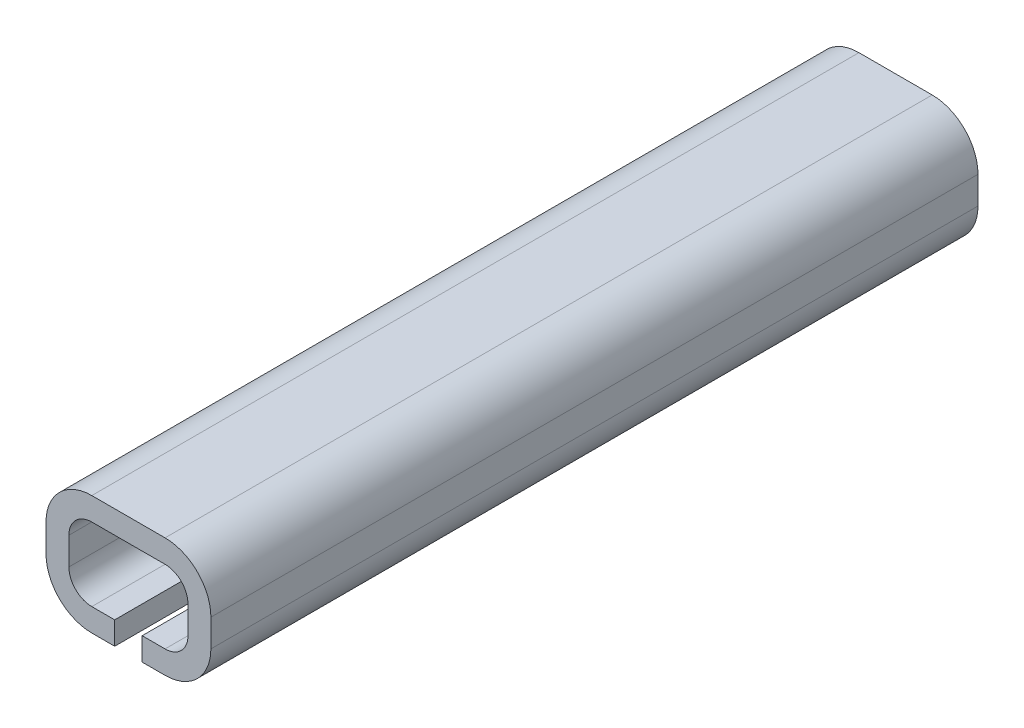
ISO-10303-21;
HEADER;
FILE_DESCRIPTION(('STEP AP214'),'2;1');
FILE_NAME('part.step','',(''),(''),'','','');
FILE_SCHEMA(('AUTOMOTIVE_DESIGN { 1 0 10303 214 1 1 1 1 }'));
ENDSEC;
DATA;
#1=APPLICATION_CONTEXT('core data for automotive mechanical design processes');
#2=APPLICATION_PROTOCOL_DEFINITION('international standard','automotive_design',2000,#1);
#3=PRODUCT_CONTEXT('',#1,'mechanical');
#4=PRODUCT('Part','Part','',(#3));
#5=PRODUCT_RELATED_PRODUCT_CATEGORY('part','',(#4));
#6=PRODUCT_DEFINITION_FORMATION('','',#4);
#7=PRODUCT_DEFINITION_CONTEXT('part definition',#1,'design');
#8=PRODUCT_DEFINITION('design','',#6,#7);
#9=PRODUCT_DEFINITION_SHAPE('','',#8);
#10=(LENGTH_UNIT() NAMED_UNIT(*) SI_UNIT(.MILLI.,.METRE.));
#11=(NAMED_UNIT(*) PLANE_ANGLE_UNIT() SI_UNIT($,.RADIAN.));
#12=(NAMED_UNIT(*) SI_UNIT($,.STERADIAN.) SOLID_ANGLE_UNIT());
#13=UNCERTAINTY_MEASURE_WITH_UNIT(LENGTH_MEASURE(1.E-05),#10,'distance_accuracy_value','');
#14=(GEOMETRIC_REPRESENTATION_CONTEXT(3) GLOBAL_UNCERTAINTY_ASSIGNED_CONTEXT((#13)) GLOBAL_UNIT_ASSIGNED_CONTEXT((#10,
#11,#12)) REPRESENTATION_CONTEXT('',''));
#15=CARTESIAN_POINT('',(0.,0.,0.));
#16=DIRECTION('',(0.,0.,1.));
#17=DIRECTION('',(1.,0.,0.));
#18=AXIS2_PLACEMENT_3D('',#15,#16,#17);
#19=CARTESIAN_POINT('',(1.6,-1.6,10.));
#20=DIRECTION('',(0.,-1.,0.));
#21=DIRECTION('',(1.,0.,0.));
#22=AXIS2_PLACEMENT_3D('',#19,#20,#21);
#23=PLANE('',#22);
#24=DIRECTION('',(-1.,0.,0.));
#25=VECTOR('',#24,1.);
#26=CARTESIAN_POINT('',(1.6,-1.6,10.));
#27=LINE('',#26,#25);
#28=CARTESIAN_POINT('',(-0.6,-1.6,10.));
#29=VERTEX_POINT('',#28);
#30=CARTESIAN_POINT('',(-1.6,-1.6,10.));
#31=VERTEX_POINT('',#30);
#32=EDGE_CURVE('E445',#29,#31,#27,.T.);
#33=ORIENTED_EDGE('',*,*,#32,.F.);
#34=DIRECTION('',(0.,0.,1.));
#35=VECTOR('',#34,1.);
#36=CARTESIAN_POINT('',(-0.6,-1.6,10.));
#37=LINE('',#36,#35);
#38=CARTESIAN_POINT('',(-0.599999999999999,-1.6,0.));
#39=VERTEX_POINT('',#38);
#40=EDGE_CURVE('E312',#39,#29,#37,.T.);
#41=ORIENTED_EDGE('',*,*,#40,.F.);
#42=DIRECTION('',(-1.,0.,0.));
#43=VECTOR('',#42,1.);
#44=CARTESIAN_POINT('',(1.6,-1.6,0.));
#45=LINE('',#44,#43);
#46=CARTESIAN_POINT('',(-1.6,-1.6,0.));
#47=VERTEX_POINT('',#46);
#48=EDGE_CURVE('E469',#39,#47,#45,.T.);
#49=ORIENTED_EDGE('',*,*,#48,.T.);
#50=DIRECTION('',(0.,0.,-1.));
#51=VECTOR('',#50,1.);
#52=CARTESIAN_POINT('',(-1.6,-1.6,10.));
#53=LINE('',#52,#51);
#54=EDGE_CURVE('E498',#31,#47,#53,.T.);
#55=ORIENTED_EDGE('',*,*,#54,.F.);
#56=EDGE_LOOP('',(#33,#41,#49,#55));
#57=FACE_BOUND('',#56,.T.);
#58=ADVANCED_FACE('F84',(#57),#23,.F.);
#59=CARTESIAN_POINT('',(1.6,-1.6,-23.5));
#60=DIRECTION('',(0.,-1.,0.));
#61=DIRECTION('',(1.,0.,0.));
#62=AXIS2_PLACEMENT_3D('',#59,#60,#61);
#63=PLANE('',#62);
#64=DIRECTION('',(-1.,0.,0.));
#65=VECTOR('',#64,1.);
#66=CARTESIAN_POINT('',(1.6,-1.6,-23.5));
#67=LINE('',#66,#65);
#68=CARTESIAN_POINT('',(1.6,-1.6,-23.5));
#69=VERTEX_POINT('',#68);
#70=CARTESIAN_POINT('',(0.599999999999999,-1.6,-23.5));
#71=VERTEX_POINT('',#70);
#72=EDGE_CURVE('E355',#69,#71,#67,.T.);
#73=ORIENTED_EDGE('',*,*,#72,.T.);
#74=DIRECTION('',(0.,0.,-1.));
#75=VECTOR('',#74,1.);
#76=CARTESIAN_POINT('',(0.599999999999999,-1.6,-23.5));
#77=LINE('',#76,#75);
#78=CARTESIAN_POINT('',(0.599999999999999,-1.6,-13.5));
#79=VERTEX_POINT('',#78);
#80=EDGE_CURVE('E375',#79,#71,#77,.T.);
#81=ORIENTED_EDGE('',*,*,#80,.F.);
#82=DIRECTION('',(-1.,0.,0.));
#83=VECTOR('',#82,1.);
#84=CARTESIAN_POINT('',(1.6,-1.6,-13.5));
#85=LINE('',#84,#83);
#86=CARTESIAN_POINT('',(1.6,-1.6,-13.5));
#87=VERTEX_POINT('',#86);
#88=EDGE_CURVE('E299',#87,#79,#85,.T.);
#89=ORIENTED_EDGE('',*,*,#88,.F.);
#90=DIRECTION('',(0.,0.,1.));
#91=VECTOR('',#90,1.);
#92=CARTESIAN_POINT('',(1.6,-1.6,-23.5));
#93=LINE('',#92,#91);
#94=EDGE_CURVE('E399',#69,#87,#93,.T.);
#95=ORIENTED_EDGE('',*,*,#94,.F.);
#96=EDGE_LOOP('',(#73,#81,#89,#95));
#97=FACE_BOUND('',#96,.T.);
#98=ADVANCED_FACE('F625',(#97),#63,.F.);
#99=CARTESIAN_POINT('',(1.6,0.600000000000001,10.));
#100=DIRECTION('',(0.,0.,-1.));
#101=DIRECTION('',(-1.,0.,0.));
#102=AXIS2_PLACEMENT_3D('',#99,#100,#101);
#103=PLANE('',#102);
#104=DIRECTION('',(-1.,0.,0.));
#105=VECTOR('',#104,1.);
#106=CARTESIAN_POINT('',(1.6,-2.6,10.));
#107=LINE('',#106,#105);
#108=CARTESIAN_POINT('',(-0.6,-2.6,10.));
#109=VERTEX_POINT('',#108);
#110=CARTESIAN_POINT('',(-1.6,-2.6,10.));
#111=VERTEX_POINT('',#110);
#112=EDGE_CURVE('E516',#109,#111,#107,.T.);
#113=ORIENTED_EDGE('',*,*,#112,.F.);
#114=DIRECTION('',(0.,-1.,0.));
#115=VECTOR('',#114,1.);
#116=CARTESIAN_POINT('',(-0.6,8.47174264961134,10.));
#117=LINE('',#116,#115);
#118=EDGE_CURVE('E328',#29,#109,#117,.T.);
#119=ORIENTED_EDGE('',*,*,#118,.F.);
#120=ORIENTED_EDGE('',*,*,#32,.T.);
#121=CARTESIAN_POINT('',(-1.6,-0.6,10.));
#122=DIRECTION('',(0.,0.,-1.));
#123=DIRECTION('',(-1.,0.,0.));
#124=AXIS2_PLACEMENT_3D('',#121,#122,#123);
#125=CIRCLE('',#124,1.);
#126=CARTESIAN_POINT('',(-2.6,-0.6,10.));
#127=VERTEX_POINT('',#126);
#128=EDGE_CURVE('E442',#31,#127,#125,.T.);
#129=ORIENTED_EDGE('',*,*,#128,.T.);
#130=DIRECTION('',(0.,1.,0.));
#131=VECTOR('',#130,1.);
#132=CARTESIAN_POINT('',(-2.6,-0.6,10.));
#133=LINE('',#132,#131);
#134=CARTESIAN_POINT('',(-2.6,0.6,10.));
#135=VERTEX_POINT('',#134);
#136=EDGE_CURVE('E438',#127,#135,#133,.T.);
#137=ORIENTED_EDGE('',*,*,#136,.T.);
#138=CARTESIAN_POINT('',(-1.6,0.6,10.));
#139=DIRECTION('',(0.,0.,1.));
#140=DIRECTION('',(1.,0.,0.));
#141=AXIS2_PLACEMENT_3D('',#138,#139,#140);
#142=CIRCLE('',#141,1.);
#143=CARTESIAN_POINT('',(-1.6,1.6,10.));
#144=VERTEX_POINT('',#143);
#145=EDGE_CURVE('E436',#144,#135,#142,.T.);
#146=ORIENTED_EDGE('',*,*,#145,.F.);
#147=DIRECTION('',(1.,0.,0.));
#148=VECTOR('',#147,1.);
#149=CARTESIAN_POINT('',(-1.6,1.6,10.));
#150=LINE('',#149,#148);
#151=CARTESIAN_POINT('',(1.6,1.6,10.));
#152=VERTEX_POINT('',#151);
#153=EDGE_CURVE('E458',#144,#152,#150,.T.);
#154=ORIENTED_EDGE('',*,*,#153,.T.);
#155=CARTESIAN_POINT('',(1.6,0.600000000000001,10.));
#156=DIRECTION('',(0.,0.,-1.));
#157=DIRECTION('',(-1.,0.,0.));
#158=AXIS2_PLACEMENT_3D('',#155,#156,#157);
#159=CIRCLE('',#158,0.999999999999999);
#160=CARTESIAN_POINT('',(2.6,0.600000000000001,10.));
#161=VERTEX_POINT('',#160);
#162=EDGE_CURVE('E455',#152,#161,#159,.T.);
#163=ORIENTED_EDGE('',*,*,#162,.T.);
#164=DIRECTION('',(0.,-1.,0.));
#165=VECTOR('',#164,1.);
#166=CARTESIAN_POINT('',(2.6,0.600000000000001,10.));
#167=LINE('',#166,#165);
#168=CARTESIAN_POINT('',(2.6,-0.6,10.));
#169=VERTEX_POINT('',#168);
#170=EDGE_CURVE('E452',#161,#169,#167,.T.);
#171=ORIENTED_EDGE('',*,*,#170,.T.);
#172=CARTESIAN_POINT('',(1.6,-0.6,10.));
#173=DIRECTION('',(0.,0.,-1.));
#174=DIRECTION('',(-1.,0.,0.));
#175=AXIS2_PLACEMENT_3D('',#172,#173,#174);
#176=CIRCLE('',#175,1.);
#177=CARTESIAN_POINT('',(1.6,-1.6,10.));
#178=VERTEX_POINT('',#177);
#179=EDGE_CURVE('E449',#169,#178,#176,.T.);
#180=ORIENTED_EDGE('',*,*,#179,.T.);
#181=CARTESIAN_POINT('',(0.599999999999999,-1.6,10.));
#182=VERTEX_POINT('',#181);
#183=EDGE_CURVE('E446',#178,#182,#27,.T.);
#184=ORIENTED_EDGE('',*,*,#183,.T.);
#185=DIRECTION('',(0.,-1.,0.));
#186=VECTOR('',#185,1.);
#187=CARTESIAN_POINT('',(0.599999999999999,8.47174264961134,10.));
#188=LINE('',#187,#186);
#189=CARTESIAN_POINT('',(0.599999999999999,-2.6,10.));
#190=VERTEX_POINT('',#189);
#191=EDGE_CURVE('E339',#182,#190,#188,.T.);
#192=ORIENTED_EDGE('',*,*,#191,.T.);
#193=CARTESIAN_POINT('',(1.6,-2.6,10.));
#194=VERTEX_POINT('',#193);
#195=EDGE_CURVE('E517',#194,#190,#107,.T.);
#196=ORIENTED_EDGE('',*,*,#195,.F.);
#197=CARTESIAN_POINT('',(1.6,-0.6,10.));
#198=DIRECTION('',(0.,0.,-1.));
#199=DIRECTION('',(-1.,0.,0.));
#200=AXIS2_PLACEMENT_3D('',#197,#198,#199);
#201=CIRCLE('',#200,2.);
#202=CARTESIAN_POINT('',(3.6,-0.6,10.));
#203=VERTEX_POINT('',#202);
#204=EDGE_CURVE('E513',#203,#194,#201,.T.);
#205=ORIENTED_EDGE('',*,*,#204,.F.);
#206=DIRECTION('',(0.,-1.,0.));
#207=VECTOR('',#206,1.);
#208=CARTESIAN_POINT('',(3.6,0.600000000000001,10.));
#209=LINE('',#208,#207);
#210=CARTESIAN_POINT('',(3.6,0.600000000000001,10.));
#211=VERTEX_POINT('',#210);
#212=EDGE_CURVE('E510',#211,#203,#209,.T.);
#213=ORIENTED_EDGE('',*,*,#212,.F.);
#214=CARTESIAN_POINT('',(1.6,0.600000000000001,10.));
#215=DIRECTION('',(0.,0.,-1.));
#216=DIRECTION('',(-1.,0.,0.));
#217=AXIS2_PLACEMENT_3D('',#214,#215,#216);
#218=CIRCLE('',#217,2.);
#219=CARTESIAN_POINT('',(1.6,2.6,10.));
#220=VERTEX_POINT('',#219);
#221=EDGE_CURVE('E507',#220,#211,#218,.T.);
#222=ORIENTED_EDGE('',*,*,#221,.F.);
#223=DIRECTION('',(1.,0.,0.));
#224=VECTOR('',#223,1.);
#225=CARTESIAN_POINT('',(-1.6,2.6,10.));
#226=LINE('',#225,#224);
#227=CARTESIAN_POINT('',(-1.6,2.6,10.));
#228=VERTEX_POINT('',#227);
#229=EDGE_CURVE('E528',#228,#220,#226,.T.);
#230=ORIENTED_EDGE('',*,*,#229,.F.);
#231=CARTESIAN_POINT('',(-1.6,0.6,10.));
#232=DIRECTION('',(0.,0.,1.));
#233=DIRECTION('',(1.,0.,0.));
#234=AXIS2_PLACEMENT_3D('',#231,#232,#233);
#235=CIRCLE('',#234,2.);
#236=CARTESIAN_POINT('',(-3.6,0.600000000000001,10.));
#237=VERTEX_POINT('',#236);
#238=EDGE_CURVE('E526',#228,#237,#235,.T.);
#239=ORIENTED_EDGE('',*,*,#238,.T.);
#240=DIRECTION('',(0.,1.,0.));
#241=VECTOR('',#240,1.);
#242=CARTESIAN_POINT('',(-3.6,-0.6,10.));
#243=LINE('',#242,#241);
#244=CARTESIAN_POINT('',(-3.6,-0.6,10.));
#245=VERTEX_POINT('',#244);
#246=EDGE_CURVE('E523',#245,#237,#243,.T.);
#247=ORIENTED_EDGE('',*,*,#246,.F.);
#248=CARTESIAN_POINT('',(-1.6,-0.6,10.));
#249=DIRECTION('',(0.,0.,-1.));
#250=DIRECTION('',(-1.,0.,0.));
#251=AXIS2_PLACEMENT_3D('',#248,#249,#250);
#252=CIRCLE('',#251,2.);
#253=EDGE_CURVE('E520',#111,#245,#252,.T.);
#254=ORIENTED_EDGE('',*,*,#253,.F.);
#255=EDGE_LOOP('',(#113,#119,#120,#129,#137,#146,#154,#163,#171,#180,#184,#192,#196,#205,#213,
#222,#230,#239,#247,#254));
#256=FACE_BOUND('',#255,.T.);
#257=ADVANCED_FACE('F559',(#256),#103,.F.);
#258=CARTESIAN_POINT('',(1.6,0.600000000000001,10.));
#259=DIRECTION('',(0.,0.,-1.));
#260=DIRECTION('',(-1.,0.,0.));
#261=AXIS2_PLACEMENT_3D('',#258,#259,#260);
#262=CYLINDRICAL_SURFACE('',#261,2.);
#263=DIRECTION('',(0.,0.,-1.));
#264=VECTOR('',#263,1.);
#265=CARTESIAN_POINT('',(3.6,0.600000000000001,10.));
#266=LINE('',#265,#264);
#267=CARTESIAN_POINT('',(3.6,0.600000000000001,-23.5));
#268=VERTEX_POINT('',#267);
#269=EDGE_CURVE('E88',#211,#268,#266,.T.);
#270=ORIENTED_EDGE('',*,*,#269,.T.);
#271=CARTESIAN_POINT('',(1.6,0.600000000000001,-23.5));
#272=DIRECTION('',(0.,0.,-1.));
#273=DIRECTION('',(-1.,0.,0.));
#274=AXIS2_PLACEMENT_3D('',#271,#272,#273);
#275=CIRCLE('',#274,2.);
#276=CARTESIAN_POINT('',(1.6,2.6,-23.5));
#277=VERTEX_POINT('',#276);
#278=EDGE_CURVE('E411',#277,#268,#275,.T.);
#279=ORIENTED_EDGE('',*,*,#278,.F.);
#280=DIRECTION('',(0.,0.,-1.));
#281=VECTOR('',#280,1.);
#282=CARTESIAN_POINT('',(1.6,2.6,10.));
#283=LINE('',#282,#281);
#284=EDGE_CURVE('E12',#220,#277,#283,.T.);
#285=ORIENTED_EDGE('',*,*,#284,.F.);
#286=ORIENTED_EDGE('',*,*,#221,.T.);
#287=EDGE_LOOP('',(#270,#279,#285,#286));
#288=FACE_BOUND('',#287,.T.);
#289=ADVANCED_FACE('F86',(#288),#262,.T.);
#290=CARTESIAN_POINT('',(1.6,2.6,10.));
#291=DIRECTION('',(0.,-1.,0.));
#292=DIRECTION('',(1.,0.,0.));
#293=AXIS2_PLACEMENT_3D('',#290,#291,#292);
#294=PLANE('',#293);
#295=ORIENTED_EDGE('',*,*,#284,.T.);
#296=DIRECTION('',(1.,0.,0.));
#297=VECTOR('',#296,1.);
#298=CARTESIAN_POINT('',(-1.6,2.6,-23.5));
#299=LINE('',#298,#297);
#300=CARTESIAN_POINT('',(-1.6,2.6,-23.5));
#301=VERTEX_POINT('',#300);
#302=EDGE_CURVE('E432',#301,#277,#299,.T.);
#303=ORIENTED_EDGE('',*,*,#302,.F.);
#304=DIRECTION('',(0.,0.,-1.));
#305=VECTOR('',#304,1.);
#306=CARTESIAN_POINT('',(-1.6,2.6,10.));
#307=LINE('',#306,#305);
#308=EDGE_CURVE('E93',#228,#301,#307,.T.);
#309=ORIENTED_EDGE('',*,*,#308,.F.);
#310=ORIENTED_EDGE('',*,*,#229,.T.);
#311=EDGE_LOOP('',(#295,#303,#309,#310));
#312=FACE_BOUND('',#311,.T.);
#313=ADVANCED_FACE('F554',(#312),#294,.F.);
#314=CARTESIAN_POINT('',(-1.6,0.6,10.));
#315=DIRECTION('',(0.,0.,-1.));
#316=DIRECTION('',(-1.,0.,0.));
#317=AXIS2_PLACEMENT_3D('',#314,#315,#316);
#318=CYLINDRICAL_SURFACE('',#317,2.);
#319=ORIENTED_EDGE('',*,*,#308,.T.);
#320=CARTESIAN_POINT('',(-1.6,0.6,-23.5));
#321=DIRECTION('',(0.,0.,1.));
#322=DIRECTION('',(1.,0.,0.));
#323=AXIS2_PLACEMENT_3D('',#320,#321,#322);
#324=CIRCLE('',#323,2.);
#325=CARTESIAN_POINT('',(-3.6,0.600000000000001,-23.5));
#326=VERTEX_POINT('',#325);
#327=EDGE_CURVE('E429',#301,#326,#324,.T.);
#328=ORIENTED_EDGE('',*,*,#327,.T.);
#329=DIRECTION('',(0.,0.,-1.));
#330=VECTOR('',#329,1.);
#331=CARTESIAN_POINT('',(-3.6,0.600000000000001,10.));
#332=LINE('',#331,#330);
#333=EDGE_CURVE('E531',#237,#326,#332,.T.);
#334=ORIENTED_EDGE('',*,*,#333,.F.);
#335=ORIENTED_EDGE('',*,*,#238,.F.);
#336=EDGE_LOOP('',(#319,#328,#334,#335));
#337=FACE_BOUND('',#336,.T.);
#338=ADVANCED_FACE('F684',(#337),#318,.T.);
#339=CARTESIAN_POINT('',(-3.6,-0.6,10.));
#340=DIRECTION('',(-1.,0.,0.));
#341=DIRECTION('',(0.,0.,1.));
#342=AXIS2_PLACEMENT_3D('',#339,#340,#341);
#343=PLANE('',#342);
#344=ORIENTED_EDGE('',*,*,#333,.T.);
#345=DIRECTION('',(0.,1.,0.));
#346=VECTOR('',#345,1.);
#347=CARTESIAN_POINT('',(-3.6,-0.6,-23.5));
#348=LINE('',#347,#346);
#349=CARTESIAN_POINT('',(-3.6,-0.6,-23.5));
#350=VERTEX_POINT('',#349);
#351=EDGE_CURVE('E426',#350,#326,#348,.T.);
#352=ORIENTED_EDGE('',*,*,#351,.F.);
#353=DIRECTION('',(0.,0.,-1.));
#354=VECTOR('',#353,1.);
#355=CARTESIAN_POINT('',(-3.6,-0.6,10.));
#356=LINE('',#355,#354);
#357=EDGE_CURVE('E533',#245,#350,#356,.T.);
#358=ORIENTED_EDGE('',*,*,#357,.F.);
#359=ORIENTED_EDGE('',*,*,#246,.T.);
#360=EDGE_LOOP('',(#344,#352,#358,#359));
#361=FACE_BOUND('',#360,.T.);
#362=ADVANCED_FACE('F687',(#361),#343,.T.);
#363=CARTESIAN_POINT('',(-1.6,-0.6,10.));
#364=DIRECTION('',(0.,0.,-1.));
#365=DIRECTION('',(-1.,0.,0.));
#366=AXIS2_PLACEMENT_3D('',#363,#364,#365);
#367=CYLINDRICAL_SURFACE('',#366,2.);
#368=ORIENTED_EDGE('',*,*,#357,.T.);
#369=CARTESIAN_POINT('',(-1.6,-0.6,-23.5));
#370=DIRECTION('',(0.,0.,-1.));
#371=DIRECTION('',(-1.,0.,0.));
#372=AXIS2_PLACEMENT_3D('',#369,#370,#371);
#373=CIRCLE('',#372,2.);
#374=CARTESIAN_POINT('',(-1.6,-2.6,-23.5));
#375=VERTEX_POINT('',#374);
#376=EDGE_CURVE('E423',#375,#350,#373,.T.);
#377=ORIENTED_EDGE('',*,*,#376,.F.);
#378=DIRECTION('',(0.,0.,-1.));
#379=VECTOR('',#378,1.);
#380=CARTESIAN_POINT('',(-1.6,-2.6,10.));
#381=LINE('',#380,#379);
#382=EDGE_CURVE('E535',#111,#375,#381,.T.);
#383=ORIENTED_EDGE('',*,*,#382,.F.);
#384=ORIENTED_EDGE('',*,*,#253,.T.);
#385=EDGE_LOOP('',(#368,#377,#383,#384));
#386=FACE_BOUND('',#385,.T.);
#387=ADVANCED_FACE('F612',(#386),#367,.T.);
#388=CARTESIAN_POINT('',(1.6,-2.6,10.));
#389=DIRECTION('',(0.,-1.,0.));
#390=DIRECTION('',(1.,0.,0.));
#391=AXIS2_PLACEMENT_3D('',#388,#389,#390);
#392=PLANE('',#391);
#393=DIRECTION('',(0.,0.,1.));
#394=VECTOR('',#393,1.);
#395=CARTESIAN_POINT('',(0.599999999999999,-2.6,-23.5));
#396=LINE('',#395,#394);
#397=CARTESIAN_POINT('',(0.599999999999999,-2.6,-23.5));
#398=VERTEX_POINT('',#397);
#399=CARTESIAN_POINT('',(0.599999999999999,-2.6,-13.5));
#400=VERTEX_POINT('',#399);
#401=EDGE_CURVE('E305',#398,#400,#396,.T.);
#402=ORIENTED_EDGE('',*,*,#401,.F.);
#403=DIRECTION('',(-1.,0.,0.));
#404=VECTOR('',#403,1.);
#405=CARTESIAN_POINT('',(1.6,-2.6,-23.5));
#406=LINE('',#405,#404);
#407=CARTESIAN_POINT('',(1.6,-2.6,-23.5));
#408=VERTEX_POINT('',#407);
#409=EDGE_CURVE('E421',#408,#398,#406,.T.);
#410=ORIENTED_EDGE('',*,*,#409,.F.);
#411=DIRECTION('',(0.,0.,-1.));
#412=VECTOR('',#411,1.);
#413=CARTESIAN_POINT('',(1.6,-2.6,10.));
#414=LINE('',#413,#412);
#415=EDGE_CURVE('E538',#194,#408,#414,.T.);
#416=ORIENTED_EDGE('',*,*,#415,.F.);
#417=ORIENTED_EDGE('',*,*,#195,.T.);
#418=DIRECTION('',(0.,0.,1.));
#419=VECTOR('',#418,1.);
#420=CARTESIAN_POINT('',(0.599999999999999,-2.6,10.));
#421=LINE('',#420,#419);
#422=CARTESIAN_POINT('',(0.600000000000001,-2.6,0.));
#423=VERTEX_POINT('',#422);
#424=EDGE_CURVE('E335',#423,#190,#421,.T.);
#425=ORIENTED_EDGE('',*,*,#424,.F.);
#426=DIRECTION('',(1.,0.,0.));
#427=VECTOR('',#426,1.);
#428=CARTESIAN_POINT('',(-0.599999999999998,-2.6,0.));
#429=LINE('',#428,#427);
#430=CARTESIAN_POINT('',(-0.599999999999998,-2.6,0.));
#431=VERTEX_POINT('',#430);
#432=EDGE_CURVE('E333',#431,#423,#429,.T.);
#433=ORIENTED_EDGE('',*,*,#432,.F.);
#434=DIRECTION('',(0.,0.,-1.));
#435=VECTOR('',#434,1.);
#436=CARTESIAN_POINT('',(-0.6,-2.6,10.));
#437=LINE('',#436,#435);
#438=EDGE_CURVE('E330',#109,#431,#437,.T.);
#439=ORIENTED_EDGE('',*,*,#438,.F.);
#440=ORIENTED_EDGE('',*,*,#112,.T.);
#441=ORIENTED_EDGE('',*,*,#382,.T.);
#442=CARTESIAN_POINT('',(-0.6,-2.6,-23.5));
#443=VERTEX_POINT('',#442);
#444=EDGE_CURVE('E420',#443,#375,#406,.T.);
#445=ORIENTED_EDGE('',*,*,#444,.F.);
#446=DIRECTION('',(0.,0.,-1.));
#447=VECTOR('',#446,1.);
#448=CARTESIAN_POINT('',(-0.6,-2.6,-23.5));
#449=LINE('',#448,#447);
#450=CARTESIAN_POINT('',(-0.6,-2.6,-13.5));
#451=VERTEX_POINT('',#450);
#452=EDGE_CURVE('E302',#451,#443,#449,.T.);
#453=ORIENTED_EDGE('',*,*,#452,.F.);
#454=DIRECTION('',(-1.,0.,0.));
#455=VECTOR('',#454,1.);
#456=CARTESIAN_POINT('',(0.599999999999999,-2.6,-13.5));
#457=LINE('',#456,#455);
#458=EDGE_CURVE('E296',#400,#451,#457,.T.);
#459=ORIENTED_EDGE('',*,*,#458,.F.);
#460=EDGE_LOOP('',(#402,#410,#416,#417,#425,#433,#439,#440,#441,#445,#453,#459));
#461=FACE_BOUND('',#460,.T.);
#462=ADVANCED_FACE('F314',(#461),#392,.T.);
#463=CARTESIAN_POINT('',(1.6,-0.6,10.));
#464=DIRECTION('',(0.,0.,-1.));
#465=DIRECTION('',(-1.,0.,0.));
#466=AXIS2_PLACEMENT_3D('',#463,#464,#465);
#467=CYLINDRICAL_SURFACE('',#466,2.);
#468=ORIENTED_EDGE('',*,*,#415,.T.);
#469=CARTESIAN_POINT('',(1.6,-0.6,-23.5));
#470=DIRECTION('',(0.,0.,-1.));
#471=DIRECTION('',(-1.,0.,0.));
#472=AXIS2_PLACEMENT_3D('',#469,#470,#471);
#473=CIRCLE('',#472,2.);
#474=CARTESIAN_POINT('',(3.6,-0.6,-23.5));
#475=VERTEX_POINT('',#474);
#476=EDGE_CURVE('E417',#475,#408,#473,.T.);
#477=ORIENTED_EDGE('',*,*,#476,.F.);
#478=DIRECTION('',(0.,0.,-1.));
#479=VECTOR('',#478,1.);
#480=CARTESIAN_POINT('',(3.6,-0.6,10.));
#481=LINE('',#480,#479);
#482=EDGE_CURVE('E539',#203,#475,#481,.T.);
#483=ORIENTED_EDGE('',*,*,#482,.F.);
#484=ORIENTED_EDGE('',*,*,#204,.T.);
#485=EDGE_LOOP('',(#468,#477,#483,#484));
#486=FACE_BOUND('',#485,.T.);
#487=ADVANCED_FACE('F563',(#486),#467,.T.);
#488=CARTESIAN_POINT('',(3.6,0.600000000000001,10.));
#489=DIRECTION('',(1.,0.,0.));
#490=DIRECTION('',(0.,0.,-1.));
#491=AXIS2_PLACEMENT_3D('',#488,#489,#490);
#492=PLANE('',#491);
#493=ORIENTED_EDGE('',*,*,#482,.T.);
#494=DIRECTION('',(0.,-1.,0.));
#495=VECTOR('',#494,1.);
#496=CARTESIAN_POINT('',(3.6,0.600000000000001,-23.5));
#497=LINE('',#496,#495);
#498=EDGE_CURVE('E414',#268,#475,#497,.T.);
#499=ORIENTED_EDGE('',*,*,#498,.F.);
#500=ORIENTED_EDGE('',*,*,#269,.F.);
#501=ORIENTED_EDGE('',*,*,#212,.T.);
#502=EDGE_LOOP('',(#493,#499,#500,#501));
#503=FACE_BOUND('',#502,.T.);
#504=ADVANCED_FACE('F548',(#503),#492,.T.);
#505=CARTESIAN_POINT('',(-1.6,0.6,10.));
#506=DIRECTION('',(0.,0.,-1.));
#507=DIRECTION('',(-1.,0.,0.));
#508=AXIS2_PLACEMENT_3D('',#505,#506,#507);
#509=CYLINDRICAL_SURFACE('',#508,1.);
#510=CARTESIAN_POINT('',(-1.6,0.6,0.));
#511=DIRECTION('',(0.,0.,1.));
#512=DIRECTION('',(1.,0.,0.));
#513=AXIS2_PLACEMENT_3D('',#510,#511,#512);
#514=CIRCLE('',#513,1.);
#515=CARTESIAN_POINT('',(-1.6,1.6,0.));
#516=VERTEX_POINT('',#515);
#517=CARTESIAN_POINT('',(-2.6,0.6,0.));
#518=VERTEX_POINT('',#517);
#519=EDGE_CURVE('E435',#516,#518,#514,.T.);
#520=ORIENTED_EDGE('',*,*,#519,.F.);
#521=DIRECTION('',(0.,0.,-1.));
#522=VECTOR('',#521,1.);
#523=CARTESIAN_POINT('',(-1.6,1.6,10.));
#524=LINE('',#523,#522);
#525=EDGE_CURVE('E461',#144,#516,#524,.T.);
#526=ORIENTED_EDGE('',*,*,#525,.F.);
#527=ORIENTED_EDGE('',*,*,#145,.T.);
#528=DIRECTION('',(0.,0.,-1.));
#529=VECTOR('',#528,1.);
#530=CARTESIAN_POINT('',(-2.6,0.6,10.));
#531=LINE('',#530,#529);
#532=EDGE_CURVE('E504',#135,#518,#531,.T.);
#533=ORIENTED_EDGE('',*,*,#532,.T.);
#534=EDGE_LOOP('',(#520,#526,#527,#533));
#535=FACE_BOUND('',#534,.T.);
#536=ADVANCED_FACE('F587',(#535),#509,.F.);
#537=CARTESIAN_POINT('',(-2.6,-0.6,10.));
#538=DIRECTION('',(-1.,0.,0.));
#539=DIRECTION('',(0.,0.,1.));
#540=AXIS2_PLACEMENT_3D('',#537,#538,#539);
#541=PLANE('',#540);
#542=DIRECTION('',(0.,1.,0.));
#543=VECTOR('',#542,1.);
#544=CARTESIAN_POINT('',(-2.6,-0.6,0.));
#545=LINE('',#544,#543);
#546=CARTESIAN_POINT('',(-2.6,-0.6,0.));
#547=VERTEX_POINT('',#546);
#548=EDGE_CURVE('E463',#547,#518,#545,.T.);
#549=ORIENTED_EDGE('',*,*,#548,.T.);
#550=ORIENTED_EDGE('',*,*,#532,.F.);
#551=ORIENTED_EDGE('',*,*,#136,.F.);
#552=DIRECTION('',(0.,0.,-1.));
#553=VECTOR('',#552,1.);
#554=CARTESIAN_POINT('',(-2.6,-0.6,10.));
#555=LINE('',#554,#553);
#556=EDGE_CURVE('E501',#127,#547,#555,.T.);
#557=ORIENTED_EDGE('',*,*,#556,.T.);
#558=EDGE_LOOP('',(#549,#550,#551,#557));
#559=FACE_BOUND('',#558,.T.);
#560=ADVANCED_FACE('F594',(#559),#541,.F.);
#561=CARTESIAN_POINT('',(-1.6,-0.6,10.));
#562=DIRECTION('',(0.,0.,-1.));
#563=DIRECTION('',(-1.,0.,0.));
#564=AXIS2_PLACEMENT_3D('',#561,#562,#563);
#565=CYLINDRICAL_SURFACE('',#564,1.);
#566=CARTESIAN_POINT('',(-1.6,-0.6,0.));
#567=DIRECTION('',(0.,0.,-1.));
#568=DIRECTION('',(-1.,0.,0.));
#569=AXIS2_PLACEMENT_3D('',#566,#567,#568);
#570=CIRCLE('',#569,1.);
#571=EDGE_CURVE('E466',#47,#547,#570,.T.);
#572=ORIENTED_EDGE('',*,*,#571,.T.);
#573=ORIENTED_EDGE('',*,*,#556,.F.);
#574=ORIENTED_EDGE('',*,*,#128,.F.);
#575=ORIENTED_EDGE('',*,*,#54,.T.);
#576=EDGE_LOOP('',(#572,#573,#574,#575));
#577=FACE_BOUND('',#576,.T.);
#578=ADVANCED_FACE('F600',(#577),#565,.F.);
#579=CARTESIAN_POINT('',(1.6,-1.6,0.));
#580=VERTEX_POINT('',#579);
#581=CARTESIAN_POINT('',(0.600000000000001,-1.6,0.));
#582=VERTEX_POINT('',#581);
#583=EDGE_CURVE('E470',#580,#582,#45,.T.);
#584=ORIENTED_EDGE('',*,*,#583,.T.);
#585=DIRECTION('',(0.,0.,-1.));
#586=VECTOR('',#585,1.);
#587=CARTESIAN_POINT('',(0.599999999999999,-1.6,10.));
#588=LINE('',#587,#586);
#589=EDGE_CURVE('E326',#182,#582,#588,.T.);
#590=ORIENTED_EDGE('',*,*,#589,.F.);
#591=ORIENTED_EDGE('',*,*,#183,.F.);
#592=DIRECTION('',(0.,0.,-1.));
#593=VECTOR('',#592,1.);
#594=CARTESIAN_POINT('',(1.6,-1.6,10.));
#595=LINE('',#594,#593);
#596=EDGE_CURVE('E495',#178,#580,#595,.T.);
#597=ORIENTED_EDGE('',*,*,#596,.T.);
#598=EDGE_LOOP('',(#584,#590,#591,#597));
#599=FACE_BOUND('',#598,.T.);
#600=ADVANCED_FACE('F574',(#599),#23,.F.);
#601=CARTESIAN_POINT('',(1.6,-0.6,10.));
#602=DIRECTION('',(0.,0.,-1.));
#603=DIRECTION('',(-1.,0.,0.));
#604=AXIS2_PLACEMENT_3D('',#601,#602,#603);
#605=CYLINDRICAL_SURFACE('',#604,1.);
#606=CARTESIAN_POINT('',(1.6,-0.6,0.));
#607=DIRECTION('',(0.,0.,-1.));
#608=DIRECTION('',(-1.,0.,0.));
#609=AXIS2_PLACEMENT_3D('',#606,#607,#608);
#610=CIRCLE('',#609,1.);
#611=CARTESIAN_POINT('',(2.6,-0.6,0.));
#612=VERTEX_POINT('',#611);
#613=EDGE_CURVE('E473',#612,#580,#610,.T.);
#614=ORIENTED_EDGE('',*,*,#613,.T.);
#615=ORIENTED_EDGE('',*,*,#596,.F.);
#616=ORIENTED_EDGE('',*,*,#179,.F.);
#617=DIRECTION('',(0.,0.,-1.));
#618=VECTOR('',#617,1.);
#619=CARTESIAN_POINT('',(2.6,-0.6,10.));
#620=LINE('',#619,#618);
#621=EDGE_CURVE('E492',#169,#612,#620,.T.);
#622=ORIENTED_EDGE('',*,*,#621,.T.);
#623=EDGE_LOOP('',(#614,#615,#616,#622));
#624=FACE_BOUND('',#623,.T.);
#625=ADVANCED_FACE('F577',(#624),#605,.F.);
#626=CARTESIAN_POINT('',(2.6,0.600000000000001,10.));
#627=DIRECTION('',(1.,0.,0.));
#628=DIRECTION('',(0.,0.,-1.));
#629=AXIS2_PLACEMENT_3D('',#626,#627,#628);
#630=PLANE('',#629);
#631=DIRECTION('',(0.,-1.,0.));
#632=VECTOR('',#631,1.);
#633=CARTESIAN_POINT('',(2.6,0.600000000000001,0.));
#634=LINE('',#633,#632);
#635=CARTESIAN_POINT('',(2.6,0.600000000000001,0.));
#636=VERTEX_POINT('',#635);
#637=EDGE_CURVE('E476',#636,#612,#634,.T.);
#638=ORIENTED_EDGE('',*,*,#637,.T.);
#639=ORIENTED_EDGE('',*,*,#621,.F.);
#640=ORIENTED_EDGE('',*,*,#170,.F.);
#641=DIRECTION('',(0.,0.,-1.));
#642=VECTOR('',#641,1.);
#643=CARTESIAN_POINT('',(2.6,0.600000000000001,10.));
#644=LINE('',#643,#642);
#645=EDGE_CURVE('E489',#161,#636,#644,.T.);
#646=ORIENTED_EDGE('',*,*,#645,.T.);
#647=EDGE_LOOP('',(#638,#639,#640,#646));
#648=FACE_BOUND('',#647,.T.);
#649=ADVANCED_FACE('F580',(#648),#630,.F.);
#650=CARTESIAN_POINT('',(1.6,0.600000000000001,10.));
#651=DIRECTION('',(0.,0.,-1.));
#652=DIRECTION('',(-1.,0.,0.));
#653=AXIS2_PLACEMENT_3D('',#650,#651,#652);
#654=CYLINDRICAL_SURFACE('',#653,0.999999999999999);
#655=CARTESIAN_POINT('',(1.6,0.600000000000001,0.));
#656=DIRECTION('',(0.,0.,-1.));
#657=DIRECTION('',(-1.,0.,0.));
#658=AXIS2_PLACEMENT_3D('',#655,#656,#657);
#659=CIRCLE('',#658,0.999999999999999);
#660=CARTESIAN_POINT('',(1.6,1.6,0.));
#661=VERTEX_POINT('',#660);
#662=EDGE_CURVE('E479',#661,#636,#659,.T.);
#663=ORIENTED_EDGE('',*,*,#662,.T.);
#664=ORIENTED_EDGE('',*,*,#645,.F.);
#665=ORIENTED_EDGE('',*,*,#162,.F.);
#666=DIRECTION('',(0.,0.,-1.));
#667=VECTOR('',#666,1.);
#668=CARTESIAN_POINT('',(1.6,1.6,10.));
#669=LINE('',#668,#667);
#670=EDGE_CURVE('E486',#152,#661,#669,.T.);
#671=ORIENTED_EDGE('',*,*,#670,.T.);
#672=EDGE_LOOP('',(#663,#664,#665,#671));
#673=FACE_BOUND('',#672,.T.);
#674=ADVANCED_FACE('F582',(#673),#654,.F.);
#675=CARTESIAN_POINT('',(-1.6,1.6,10.));
#676=DIRECTION('',(0.,1.,0.));
#677=DIRECTION('',(0.,0.,1.));
#678=AXIS2_PLACEMENT_3D('',#675,#676,#677);
#679=PLANE('',#678);
#680=DIRECTION('',(1.,0.,0.));
#681=VECTOR('',#680,1.);
#682=CARTESIAN_POINT('',(-1.6,1.6,0.));
#683=LINE('',#682,#681);
#684=EDGE_CURVE('E439',#516,#661,#683,.T.);
#685=ORIENTED_EDGE('',*,*,#684,.T.);
#686=ORIENTED_EDGE('',*,*,#670,.F.);
#687=ORIENTED_EDGE('',*,*,#153,.F.);
#688=ORIENTED_EDGE('',*,*,#525,.T.);
#689=EDGE_LOOP('',(#685,#686,#687,#688));
#690=FACE_BOUND('',#689,.T.);
#691=ADVANCED_FACE('F590',(#690),#679,.F.);
#692=CARTESIAN_POINT('',(1.6,0.600000000000001,0.));
#693=DIRECTION('',(0.,0.,-1.));
#694=DIRECTION('',(-1.,0.,0.));
#695=AXIS2_PLACEMENT_3D('',#692,#693,#694);
#696=PLANE('',#695);
#697=ORIENTED_EDGE('',*,*,#684,.F.);
#698=ORIENTED_EDGE('',*,*,#519,.T.);
#699=ORIENTED_EDGE('',*,*,#548,.F.);
#700=ORIENTED_EDGE('',*,*,#571,.F.);
#701=ORIENTED_EDGE('',*,*,#48,.F.);
#702=DIRECTION('',(0.,-1.,0.));
#703=VECTOR('',#702,1.);
#704=CARTESIAN_POINT('',(-0.599999999999999,8.47174264961134,0.));
#705=LINE('',#704,#703);
#706=EDGE_CURVE('E337',#39,#431,#705,.T.);
#707=ORIENTED_EDGE('',*,*,#706,.T.);
#708=ORIENTED_EDGE('',*,*,#432,.T.);
#709=DIRECTION('',(0.,-1.,0.));
#710=VECTOR('',#709,1.);
#711=CARTESIAN_POINT('',(0.6,8.47174264961134,0.));
#712=LINE('',#711,#710);
#713=EDGE_CURVE('E101',#582,#423,#712,.T.);
#714=ORIENTED_EDGE('',*,*,#713,.F.);
#715=ORIENTED_EDGE('',*,*,#583,.F.);
#716=ORIENTED_EDGE('',*,*,#613,.F.);
#717=ORIENTED_EDGE('',*,*,#637,.F.);
#718=ORIENTED_EDGE('',*,*,#662,.F.);
#719=EDGE_LOOP('',(#697,#698,#699,#700,#701,#707,#708,#714,#715,#716,#717,#718));
#720=FACE_BOUND('',#719,.T.);
#721=ADVANCED_FACE('F575',(#720),#696,.F.);
#722=CARTESIAN_POINT('',(1.6,0.600000000000001,-23.5));
#723=DIRECTION('',(0.,0.,1.));
#724=DIRECTION('',(-1.,0.,0.));
#725=AXIS2_PLACEMENT_3D('',#722,#723,#724);
#726=PLANE('',#725);
#727=ORIENTED_EDGE('',*,*,#409,.T.);
#728=DIRECTION('',(0.,-1.,0.));
#729=VECTOR('',#728,1.);
#730=CARTESIAN_POINT('',(0.599999999999999,8.47174264961134,-23.5));
#731=LINE('',#730,#729);
#732=EDGE_CURVE('E308',#71,#398,#731,.T.);
#733=ORIENTED_EDGE('',*,*,#732,.F.);
#734=ORIENTED_EDGE('',*,*,#72,.F.);
#735=CARTESIAN_POINT('',(1.6,-0.6,-23.5));
#736=DIRECTION('',(0.,0.,-1.));
#737=DIRECTION('',(-1.,0.,0.));
#738=AXIS2_PLACEMENT_3D('',#735,#736,#737);
#739=CIRCLE('',#738,1.);
#740=CARTESIAN_POINT('',(2.6,-0.6,-23.5));
#741=VERTEX_POINT('',#740);
#742=EDGE_CURVE('E358',#741,#69,#739,.T.);
#743=ORIENTED_EDGE('',*,*,#742,.F.);
#744=DIRECTION('',(0.,-1.,0.));
#745=VECTOR('',#744,1.);
#746=CARTESIAN_POINT('',(2.6,0.600000000000001,-23.5));
#747=LINE('',#746,#745);
#748=CARTESIAN_POINT('',(2.6,0.600000000000001,-23.5));
#749=VERTEX_POINT('',#748);
#750=EDGE_CURVE('E361',#749,#741,#747,.T.);
#751=ORIENTED_EDGE('',*,*,#750,.F.);
#752=CARTESIAN_POINT('',(1.6,0.600000000000001,-23.5));
#753=DIRECTION('',(0.,0.,-1.));
#754=DIRECTION('',(-1.,0.,0.));
#755=AXIS2_PLACEMENT_3D('',#752,#753,#754);
#756=CIRCLE('',#755,0.999999999999999);
#757=CARTESIAN_POINT('',(1.6,1.6,-23.5));
#758=VERTEX_POINT('',#757);
#759=EDGE_CURVE('E364',#758,#749,#756,.T.);
#760=ORIENTED_EDGE('',*,*,#759,.F.);
#761=DIRECTION('',(1.,0.,0.));
#762=VECTOR('',#761,1.);
#763=CARTESIAN_POINT('',(-1.6,1.6,-23.5));
#764=LINE('',#763,#762);
#765=CARTESIAN_POINT('',(-1.6,1.6,-23.5));
#766=VERTEX_POINT('',#765);
#767=EDGE_CURVE('E367',#766,#758,#764,.T.);
#768=ORIENTED_EDGE('',*,*,#767,.F.);
#769=CARTESIAN_POINT('',(-1.6,0.6,-23.5));
#770=DIRECTION('',(0.,0.,1.));
#771=DIRECTION('',(1.,0.,0.));
#772=AXIS2_PLACEMENT_3D('',#769,#770,#771);
#773=CIRCLE('',#772,1.);
#774=CARTESIAN_POINT('',(-2.6,0.6,-23.5));
#775=VERTEX_POINT('',#774);
#776=EDGE_CURVE('E344',#766,#775,#773,.T.);
#777=ORIENTED_EDGE('',*,*,#776,.T.);
#778=DIRECTION('',(0.,1.,0.));
#779=VECTOR('',#778,1.);
#780=CARTESIAN_POINT('',(-2.6,-0.6,-23.5));
#781=LINE('',#780,#779);
#782=CARTESIAN_POINT('',(-2.6,-0.6,-23.5));
#783=VERTEX_POINT('',#782);
#784=EDGE_CURVE('E347',#783,#775,#781,.T.);
#785=ORIENTED_EDGE('',*,*,#784,.F.);
#786=CARTESIAN_POINT('',(-1.6,-0.6,-23.5));
#787=DIRECTION('',(0.,0.,-1.));
#788=DIRECTION('',(-1.,0.,0.));
#789=AXIS2_PLACEMENT_3D('',#786,#787,#788);
#790=CIRCLE('',#789,1.);
#791=CARTESIAN_POINT('',(-1.6,-1.6,-23.5));
#792=VERTEX_POINT('',#791);
#793=EDGE_CURVE('E351',#792,#783,#790,.T.);
#794=ORIENTED_EDGE('',*,*,#793,.F.);
#795=CARTESIAN_POINT('',(-0.6,-1.6,-23.5));
#796=VERTEX_POINT('',#795);
#797=EDGE_CURVE('E354',#796,#792,#67,.T.);
#798=ORIENTED_EDGE('',*,*,#797,.F.);
#799=DIRECTION('',(0.,-1.,0.));
#800=VECTOR('',#799,1.);
#801=CARTESIAN_POINT('',(-0.6,8.47174264961134,-23.5));
#802=LINE('',#801,#800);
#803=EDGE_CURVE('E322',#796,#443,#802,.T.);
#804=ORIENTED_EDGE('',*,*,#803,.T.);
#805=ORIENTED_EDGE('',*,*,#444,.T.);
#806=ORIENTED_EDGE('',*,*,#376,.T.);
#807=ORIENTED_EDGE('',*,*,#351,.T.);
#808=ORIENTED_EDGE('',*,*,#327,.F.);
#809=ORIENTED_EDGE('',*,*,#302,.T.);
#810=ORIENTED_EDGE('',*,*,#278,.T.);
#811=ORIENTED_EDGE('',*,*,#498,.T.);
#812=ORIENTED_EDGE('',*,*,#476,.T.);
#813=EDGE_LOOP('',(#727,#733,#734,#743,#751,#760,#768,#777,#785,#794,#798,#804,#805,#806,#807,
#808,#809,#810,#811,#812));
#814=FACE_BOUND('',#813,.T.);
#815=ADVANCED_FACE('F550',(#814),#726,.F.);
#816=CARTESIAN_POINT('',(-1.6,0.6,-23.5));
#817=DIRECTION('',(0.,0.,1.));
#818=DIRECTION('',(-1.,0.,0.));
#819=AXIS2_PLACEMENT_3D('',#816,#817,#818);
#820=CYLINDRICAL_SURFACE('',#819,1.);
#821=CARTESIAN_POINT('',(-1.6,0.6,-13.5));
#822=DIRECTION('',(0.,0.,1.));
#823=DIRECTION('',(1.,0.,0.));
#824=AXIS2_PLACEMENT_3D('',#821,#822,#823);
#825=CIRCLE('',#824,1.);
#826=CARTESIAN_POINT('',(-1.6,1.6,-13.5));
#827=VERTEX_POINT('',#826);
#828=CARTESIAN_POINT('',(-2.6,0.6,-13.5));
#829=VERTEX_POINT('',#828);
#830=EDGE_CURVE('E371',#827,#829,#825,.T.);
#831=ORIENTED_EDGE('',*,*,#830,.T.);
#832=DIRECTION('',(0.,0.,1.));
#833=VECTOR('',#832,1.);
#834=CARTESIAN_POINT('',(-2.6,0.6,-23.5));
#835=LINE('',#834,#833);
#836=EDGE_CURVE('E408',#775,#829,#835,.T.);
#837=ORIENTED_EDGE('',*,*,#836,.F.);
#838=ORIENTED_EDGE('',*,*,#776,.F.);
#839=DIRECTION('',(0.,0.,1.));
#840=VECTOR('',#839,1.);
#841=CARTESIAN_POINT('',(-1.6,1.6,-23.5));
#842=LINE('',#841,#840);
#843=EDGE_CURVE('E370',#766,#827,#842,.T.);
#844=ORIENTED_EDGE('',*,*,#843,.T.);
#845=EDGE_LOOP('',(#831,#837,#838,#844));
#846=FACE_BOUND('',#845,.T.);
#847=ADVANCED_FACE('F643',(#846),#820,.F.);
#848=CARTESIAN_POINT('',(-2.6,-0.6,-23.5));
#849=DIRECTION('',(-1.,0.,0.));
#850=DIRECTION('',(0.,0.,-1.));
#851=AXIS2_PLACEMENT_3D('',#848,#849,#850);
#852=PLANE('',#851);
#853=DIRECTION('',(0.,1.,0.));
#854=VECTOR('',#853,1.);
#855=CARTESIAN_POINT('',(-2.6,-0.6,-13.5));
#856=LINE('',#855,#854);
#857=CARTESIAN_POINT('',(-2.6,-0.6,-13.5));
#858=VERTEX_POINT('',#857);
#859=EDGE_CURVE('E374',#858,#829,#856,.T.);
#860=ORIENTED_EDGE('',*,*,#859,.F.);
#861=DIRECTION('',(0.,0.,1.));
#862=VECTOR('',#861,1.);
#863=CARTESIAN_POINT('',(-2.6,-0.6,-23.5));
#864=LINE('',#863,#862);
#865=EDGE_CURVE('E405',#783,#858,#864,.T.);
#866=ORIENTED_EDGE('',*,*,#865,.F.);
#867=ORIENTED_EDGE('',*,*,#784,.T.);
#868=ORIENTED_EDGE('',*,*,#836,.T.);
#869=EDGE_LOOP('',(#860,#866,#867,#868));
#870=FACE_BOUND('',#869,.T.);
#871=ADVANCED_FACE('F647',(#870),#852,.F.);
#872=CARTESIAN_POINT('',(-1.6,-0.6,-23.5));
#873=DIRECTION('',(0.,0.,1.));
#874=DIRECTION('',(-1.,0.,0.));
#875=AXIS2_PLACEMENT_3D('',#872,#873,#874);
#876=CYLINDRICAL_SURFACE('',#875,1.);
#877=CARTESIAN_POINT('',(-1.6,-0.6,-13.5));
#878=DIRECTION('',(0.,0.,-1.));
#879=DIRECTION('',(-1.,0.,0.));
#880=AXIS2_PLACEMENT_3D('',#877,#878,#879);
#881=CIRCLE('',#880,1.);
#882=CARTESIAN_POINT('',(-1.6,-1.6,-13.5));
#883=VERTEX_POINT('',#882);
#884=EDGE_CURVE('E377',#883,#858,#881,.T.);
#885=ORIENTED_EDGE('',*,*,#884,.F.);
#886=DIRECTION('',(0.,0.,1.));
#887=VECTOR('',#886,1.);
#888=CARTESIAN_POINT('',(-1.6,-1.6,-23.5));
#889=LINE('',#888,#887);
#890=EDGE_CURVE('E402',#792,#883,#889,.T.);
#891=ORIENTED_EDGE('',*,*,#890,.F.);
#892=ORIENTED_EDGE('',*,*,#793,.T.);
#893=ORIENTED_EDGE('',*,*,#865,.T.);
#894=EDGE_LOOP('',(#885,#891,#892,#893));
#895=FACE_BOUND('',#894,.T.);
#896=ADVANCED_FACE('F650',(#895),#876,.F.);
#897=CARTESIAN_POINT('',(-0.599999999999999,-1.6,-13.5));
#898=VERTEX_POINT('',#897);
#899=EDGE_CURVE('E379',#898,#883,#85,.T.);
#900=ORIENTED_EDGE('',*,*,#899,.F.);
#901=DIRECTION('',(0.,0.,1.));
#902=VECTOR('',#901,1.);
#903=CARTESIAN_POINT('',(-0.6,-1.6,-23.5));
#904=LINE('',#903,#902);
#905=EDGE_CURVE('E321',#796,#898,#904,.T.);
#906=ORIENTED_EDGE('',*,*,#905,.F.);
#907=ORIENTED_EDGE('',*,*,#797,.T.);
#908=ORIENTED_EDGE('',*,*,#890,.T.);
#909=EDGE_LOOP('',(#900,#906,#907,#908));
#910=FACE_BOUND('',#909,.T.);
#911=ADVANCED_FACE('F621',(#910),#63,.F.);
#912=CARTESIAN_POINT('',(1.6,-0.6,-23.5));
#913=DIRECTION('',(0.,0.,1.));
#914=DIRECTION('',(-1.,0.,0.));
#915=AXIS2_PLACEMENT_3D('',#912,#913,#914);
#916=CYLINDRICAL_SURFACE('',#915,1.);
#917=CARTESIAN_POINT('',(1.6,-0.6,-13.5));
#918=DIRECTION('',(0.,0.,-1.));
#919=DIRECTION('',(-1.,0.,0.));
#920=AXIS2_PLACEMENT_3D('',#917,#918,#919);
#921=CIRCLE('',#920,1.);
#922=CARTESIAN_POINT('',(2.6,-0.6,-13.5));
#923=VERTEX_POINT('',#922);
#924=EDGE_CURVE('E381',#923,#87,#921,.T.);
#925=ORIENTED_EDGE('',*,*,#924,.F.);
#926=DIRECTION('',(0.,0.,1.));
#927=VECTOR('',#926,1.);
#928=CARTESIAN_POINT('',(2.6,-0.6,-23.5));
#929=LINE('',#928,#927);
#930=EDGE_CURVE('E396',#741,#923,#929,.T.);
#931=ORIENTED_EDGE('',*,*,#930,.F.);
#932=ORIENTED_EDGE('',*,*,#742,.T.);
#933=ORIENTED_EDGE('',*,*,#94,.T.);
#934=EDGE_LOOP('',(#925,#931,#932,#933));
#935=FACE_BOUND('',#934,.T.);
#936=ADVANCED_FACE('F631',(#935),#916,.F.);
#937=CARTESIAN_POINT('',(2.6,0.600000000000001,-23.5));
#938=DIRECTION('',(1.,0.,0.));
#939=DIRECTION('',(0.,0.,1.));
#940=AXIS2_PLACEMENT_3D('',#937,#938,#939);
#941=PLANE('',#940);
#942=DIRECTION('',(0.,-1.,0.));
#943=VECTOR('',#942,1.);
#944=CARTESIAN_POINT('',(2.6,0.600000000000001,-13.5));
#945=LINE('',#944,#943);
#946=CARTESIAN_POINT('',(2.6,0.600000000000001,-13.5));
#947=VERTEX_POINT('',#946);
#948=EDGE_CURVE('E383',#947,#923,#945,.T.);
#949=ORIENTED_EDGE('',*,*,#948,.F.);
#950=DIRECTION('',(0.,0.,1.));
#951=VECTOR('',#950,1.);
#952=CARTESIAN_POINT('',(2.6,0.600000000000001,-23.5));
#953=LINE('',#952,#951);
#954=EDGE_CURVE('E393',#749,#947,#953,.T.);
#955=ORIENTED_EDGE('',*,*,#954,.F.);
#956=ORIENTED_EDGE('',*,*,#750,.T.);
#957=ORIENTED_EDGE('',*,*,#930,.T.);
#958=EDGE_LOOP('',(#949,#955,#956,#957));
#959=FACE_BOUND('',#958,.T.);
#960=ADVANCED_FACE('F634',(#959),#941,.F.);
#961=CARTESIAN_POINT('',(1.6,0.600000000000001,-23.5));
#962=DIRECTION('',(0.,0.,1.));
#963=DIRECTION('',(-1.,0.,0.));
#964=AXIS2_PLACEMENT_3D('',#961,#962,#963);
#965=CYLINDRICAL_SURFACE('',#964,0.999999999999999);
#966=CARTESIAN_POINT('',(1.6,0.600000000000001,-13.5));
#967=DIRECTION('',(0.,0.,-1.));
#968=DIRECTION('',(-1.,0.,0.));
#969=AXIS2_PLACEMENT_3D('',#966,#967,#968);
#970=CIRCLE('',#969,0.999999999999999);
#971=CARTESIAN_POINT('',(1.6,1.6,-13.5));
#972=VERTEX_POINT('',#971);
#973=EDGE_CURVE('E385',#972,#947,#970,.T.);
#974=ORIENTED_EDGE('',*,*,#973,.F.);
#975=DIRECTION('',(0.,0.,1.));
#976=VECTOR('',#975,1.);
#977=CARTESIAN_POINT('',(1.6,1.6,-23.5));
#978=LINE('',#977,#976);
#979=EDGE_CURVE('E390',#758,#972,#978,.T.);
#980=ORIENTED_EDGE('',*,*,#979,.F.);
#981=ORIENTED_EDGE('',*,*,#759,.T.);
#982=ORIENTED_EDGE('',*,*,#954,.T.);
#983=EDGE_LOOP('',(#974,#980,#981,#982));
#984=FACE_BOUND('',#983,.T.);
#985=ADVANCED_FACE('F637',(#984),#965,.F.);
#986=CARTESIAN_POINT('',(-1.6,1.6,-23.5));
#987=DIRECTION('',(0.,1.,0.));
#988=DIRECTION('',(0.,0.,-1.));
#989=AXIS2_PLACEMENT_3D('',#986,#987,#988);
#990=PLANE('',#989);
#991=DIRECTION('',(1.,0.,0.));
#992=VECTOR('',#991,1.);
#993=CARTESIAN_POINT('',(-1.6,1.6,-13.5));
#994=LINE('',#993,#992);
#995=EDGE_CURVE('E348',#827,#972,#994,.T.);
#996=ORIENTED_EDGE('',*,*,#995,.F.);
#997=ORIENTED_EDGE('',*,*,#843,.F.);
#998=ORIENTED_EDGE('',*,*,#767,.T.);
#999=ORIENTED_EDGE('',*,*,#979,.T.);
#1000=EDGE_LOOP('',(#996,#997,#998,#999));
#1001=FACE_BOUND('',#1000,.T.);
#1002=ADVANCED_FACE('F651',(#1001),#990,.F.);
#1003=CARTESIAN_POINT('',(1.6,0.600000000000001,-13.5));
#1004=DIRECTION('',(0.,0.,1.));
#1005=DIRECTION('',(-1.,0.,0.));
#1006=AXIS2_PLACEMENT_3D('',#1003,#1004,#1005);
#1007=PLANE('',#1006);
#1008=ORIENTED_EDGE('',*,*,#995,.T.);
#1009=ORIENTED_EDGE('',*,*,#973,.T.);
#1010=ORIENTED_EDGE('',*,*,#948,.T.);
#1011=ORIENTED_EDGE('',*,*,#924,.T.);
#1012=ORIENTED_EDGE('',*,*,#88,.T.);
#1013=DIRECTION('',(0.,-1.,0.));
#1014=VECTOR('',#1013,1.);
#1015=CARTESIAN_POINT('',(0.599999999999999,8.47174264961134,-13.5));
#1016=LINE('',#1015,#1014);
#1017=EDGE_CURVE('E292',#79,#400,#1016,.T.);
#1018=ORIENTED_EDGE('',*,*,#1017,.T.);
#1019=ORIENTED_EDGE('',*,*,#458,.T.);
#1020=DIRECTION('',(0.,-1.,0.));
#1021=VECTOR('',#1020,1.);
#1022=CARTESIAN_POINT('',(-0.6,8.47174264961134,-13.5));
#1023=LINE('',#1022,#1021);
#1024=EDGE_CURVE('E109',#898,#451,#1023,.T.);
#1025=ORIENTED_EDGE('',*,*,#1024,.F.);
#1026=ORIENTED_EDGE('',*,*,#899,.T.);
#1027=ORIENTED_EDGE('',*,*,#884,.T.);
#1028=ORIENTED_EDGE('',*,*,#859,.T.);
#1029=ORIENTED_EDGE('',*,*,#830,.F.);
#1030=EDGE_LOOP('',(#1008,#1009,#1010,#1011,#1012,#1018,#1019,#1025,#1026,#1027,#1028,#1029));
#1031=FACE_BOUND('',#1030,.T.);
#1032=ADVANCED_FACE('F294',(#1031),#1007,.F.);
#1033=CARTESIAN_POINT('',(0.599999999999999,8.47174264961134,-23.5));
#1034=DIRECTION('',(1.,0.,0.));
#1035=DIRECTION('',(0.,1.,0.));
#1036=AXIS2_PLACEMENT_3D('',#1033,#1034,#1035);
#1037=PLANE('',#1036);
#1038=ORIENTED_EDGE('',*,*,#80,.T.);
#1039=ORIENTED_EDGE('',*,*,#732,.T.);
#1040=ORIENTED_EDGE('',*,*,#401,.T.);
#1041=ORIENTED_EDGE('',*,*,#1017,.F.);
#1042=EDGE_LOOP('',(#1038,#1039,#1040,#1041));
#1043=FACE_BOUND('',#1042,.T.);
#1044=ADVANCED_FACE('F306',(#1043),#1037,.F.);
#1045=CARTESIAN_POINT('',(-0.6,8.47174264961134,-23.5));
#1046=DIRECTION('',(-1.,0.,0.));
#1047=DIRECTION('',(0.,-1.,0.));
#1048=AXIS2_PLACEMENT_3D('',#1045,#1046,#1047);
#1049=PLANE('',#1048);
#1050=ORIENTED_EDGE('',*,*,#905,.T.);
#1051=ORIENTED_EDGE('',*,*,#1024,.T.);
#1052=ORIENTED_EDGE('',*,*,#452,.T.);
#1053=ORIENTED_EDGE('',*,*,#803,.F.);
#1054=EDGE_LOOP('',(#1050,#1051,#1052,#1053));
#1055=FACE_BOUND('',#1054,.T.);
#1056=ADVANCED_FACE('F618',(#1055),#1049,.F.);
#1057=CARTESIAN_POINT('',(-0.6,8.47174264961134,10.));
#1058=DIRECTION('',(-1.,0.,0.));
#1059=DIRECTION('',(0.,0.,1.));
#1060=AXIS2_PLACEMENT_3D('',#1057,#1058,#1059);
#1061=PLANE('',#1060);
#1062=ORIENTED_EDGE('',*,*,#40,.T.);
#1063=ORIENTED_EDGE('',*,*,#118,.T.);
#1064=ORIENTED_EDGE('',*,*,#438,.T.);
#1065=ORIENTED_EDGE('',*,*,#706,.F.);
#1066=EDGE_LOOP('',(#1062,#1063,#1064,#1065));
#1067=FACE_BOUND('',#1066,.T.);
#1068=ADVANCED_FACE('F606',(#1067),#1061,.F.);
#1069=CARTESIAN_POINT('',(0.599999999999999,8.47174264961134,10.));
#1070=DIRECTION('',(1.,0.,0.));
#1071=DIRECTION('',(0.,0.,-1.));
#1072=AXIS2_PLACEMENT_3D('',#1069,#1070,#1071);
#1073=PLANE('',#1072);
#1074=ORIENTED_EDGE('',*,*,#589,.T.);
#1075=ORIENTED_EDGE('',*,*,#713,.T.);
#1076=ORIENTED_EDGE('',*,*,#424,.T.);
#1077=ORIENTED_EDGE('',*,*,#191,.F.);
#1078=EDGE_LOOP('',(#1074,#1075,#1076,#1077));
#1079=FACE_BOUND('',#1078,.T.);
#1080=ADVANCED_FACE('F569',(#1079),#1073,.F.);
#1081=CLOSED_SHELL('',(#58,#98,#257,#289,#313,#338,#362,#387,#462,#487,#504,#536,#560,#578,#600,
#625,#649,#674,#691,#721,#815,#847,#871,#896,#911,#936,#960,#985,#1002,#1032,#1044,#1056,#1068,#1080));
#1082=MANIFOLD_SOLID_BREP('B2',#1081);
#1083=ADVANCED_BREP_SHAPE_REPRESENTATION('',(#18,#1082),#14);
#1084=SHAPE_DEFINITION_REPRESENTATION(#9,#1083);
ENDSEC;
END-ISO-10303-21;
